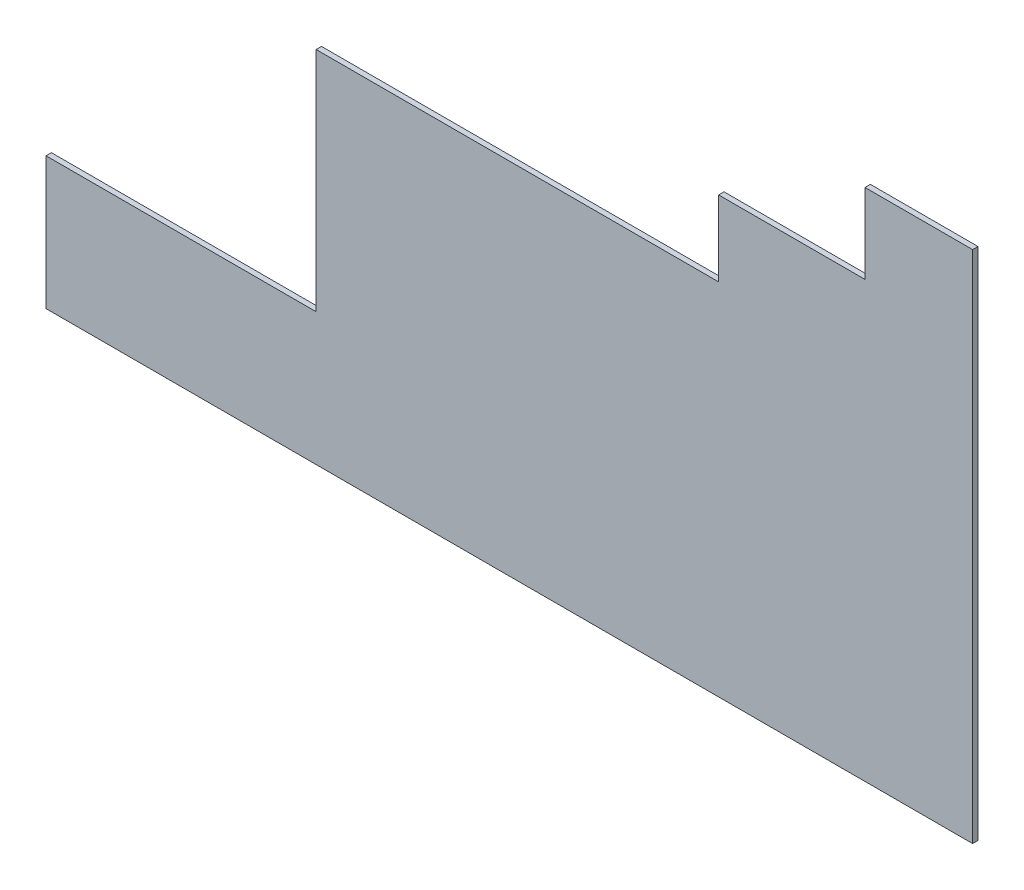
ISO-10303-21;
HEADER;
FILE_DESCRIPTION(('STEP AP214'),'2;1');
FILE_NAME('part.step','',(''),(''),'','','');
FILE_SCHEMA(('AUTOMOTIVE_DESIGN { 1 0 10303 214 1 1 1 1 }'));
ENDSEC;
DATA;
#1=APPLICATION_CONTEXT('core data for automotive mechanical design processes');
#2=APPLICATION_PROTOCOL_DEFINITION('international standard','automotive_design',2000,#1);
#3=PRODUCT_CONTEXT('',#1,'mechanical');
#4=PRODUCT('Part','Part','',(#3));
#5=PRODUCT_RELATED_PRODUCT_CATEGORY('part','',(#4));
#6=PRODUCT_DEFINITION_FORMATION('','',#4);
#7=PRODUCT_DEFINITION_CONTEXT('part definition',#1,'design');
#8=PRODUCT_DEFINITION('design','',#6,#7);
#9=PRODUCT_DEFINITION_SHAPE('','',#8);
#10=(LENGTH_UNIT() NAMED_UNIT(*) SI_UNIT(.MILLI.,.METRE.));
#11=(NAMED_UNIT(*) PLANE_ANGLE_UNIT() SI_UNIT($,.RADIAN.));
#12=(NAMED_UNIT(*) SI_UNIT($,.STERADIAN.) SOLID_ANGLE_UNIT());
#13=UNCERTAINTY_MEASURE_WITH_UNIT(LENGTH_MEASURE(1.E-05),#10,'distance_accuracy_value','');
#14=(GEOMETRIC_REPRESENTATION_CONTEXT(3) GLOBAL_UNCERTAINTY_ASSIGNED_CONTEXT((#13)) GLOBAL_UNIT_ASSIGNED_CONTEXT((#10,
#11,#12)) REPRESENTATION_CONTEXT('',''));
#15=CARTESIAN_POINT('',(0.,0.,0.));
#16=DIRECTION('',(0.,0.,1.));
#17=DIRECTION('',(1.,0.,0.));
#18=AXIS2_PLACEMENT_3D('',#15,#16,#17);
#19=CARTESIAN_POINT('',(6002.,0.,-25.));
#20=DIRECTION('',(0.,-1.,0.));
#21=DIRECTION('',(1.,0.,0.));
#22=AXIS2_PLACEMENT_3D('',#19,#20,#21);
#23=PLANE('',#22);
#24=DIRECTION('',(1.,0.,0.));
#25=VECTOR('',#24,1.);
#26=CARTESIAN_POINT('',(6002.,0.,0.));
#27=LINE('',#26,#25);
#28=CARTESIAN_POINT('',(1405.,0.,0.));
#29=VERTEX_POINT('',#28);
#30=CARTESIAN_POINT('',(5710.,0.,0.));
#31=VERTEX_POINT('',#30);
#32=EDGE_CURVE('E158',#29,#31,#27,.T.);
#33=ORIENTED_EDGE('',*,*,#32,.F.);
#34=DIRECTION('',(0.,0.,1.));
#35=VECTOR('',#34,1.);
#36=CARTESIAN_POINT('',(1405.,0.,-25.000025));
#37=LINE('',#36,#35);
#38=CARTESIAN_POINT('',(1405.,0.,-25.));
#39=VERTEX_POINT('',#38);
#40=EDGE_CURVE('E183',#39,#29,#37,.T.);
#41=ORIENTED_EDGE('',*,*,#40,.F.);
#42=DIRECTION('',(1.,0.,0.));
#43=VECTOR('',#42,1.);
#44=CARTESIAN_POINT('',(6002.,0.,-25.));
#45=LINE('',#44,#43);
#46=CARTESIAN_POINT('',(5710.,0.,-25.));
#47=VERTEX_POINT('',#46);
#48=EDGE_CURVE('E159',#39,#47,#45,.T.);
#49=ORIENTED_EDGE('',*,*,#48,.T.);
#50=DIRECTION('',(0.,0.,1.));
#51=VECTOR('',#50,1.);
#52=CARTESIAN_POINT('',(5710.,0.,-25.));
#53=LINE('',#52,#51);
#54=EDGE_CURVE('E149',#47,#31,#53,.T.);
#55=ORIENTED_EDGE('',*,*,#54,.T.);
#56=EDGE_LOOP('',(#33,#41,#49,#55));
#57=FACE_BOUND('',#56,.T.);
#58=ADVANCED_FACE('F40',(#57),#23,.T.);
#59=CARTESIAN_POINT('',(0.,0.,-25.));
#60=DIRECTION('',(0.,0.,-1.));
#61=DIRECTION('',(-1.,0.,0.));
#62=AXIS2_PLACEMENT_3D('',#59,#60,#61);
#63=PLANE('',#62);
#64=DIRECTION('',(-1.,0.,0.));
#65=VECTOR('',#64,1.);
#66=CARTESIAN_POINT('',(0.,615.,-25.));
#67=LINE('',#66,#65);
#68=CARTESIAN_POINT('',(2660.,615.,-25.));
#69=VERTEX_POINT('',#68);
#70=CARTESIAN_POINT('',(1405.,615.,-25.));
#71=VERTEX_POINT('',#70);
#72=EDGE_CURVE('E131',#69,#71,#67,.T.);
#73=ORIENTED_EDGE('',*,*,#72,.F.);
#74=DIRECTION('',(0.,1.,0.));
#75=VECTOR('',#74,1.);
#76=CARTESIAN_POINT('',(2660.,0.,-25.));
#77=LINE('',#76,#75);
#78=CARTESIAN_POINT('',(2660.,1670.,-25.));
#79=VERTEX_POINT('',#78);
#80=EDGE_CURVE('E117',#69,#79,#77,.T.);
#81=ORIENTED_EDGE('',*,*,#80,.T.);
#82=DIRECTION('',(1.,0.,0.));
#83=VECTOR('',#82,1.);
#84=CARTESIAN_POINT('',(4300.,1670.,-25.));
#85=LINE('',#84,#83);
#86=CARTESIAN_POINT('',(4530.,1670.,-25.));
#87=VERTEX_POINT('',#86);
#88=EDGE_CURVE('E128',#79,#87,#85,.T.);
#89=ORIENTED_EDGE('',*,*,#88,.T.);
#90=DIRECTION('',(0.,1.,0.));
#91=VECTOR('',#90,1.);
#92=CARTESIAN_POINT('',(4530.,1670.,-25.));
#93=LINE('',#92,#91);
#94=CARTESIAN_POINT('',(4530.,2020.,-25.));
#95=VERTEX_POINT('',#94);
#96=EDGE_CURVE('E197',#87,#95,#93,.T.);
#97=ORIENTED_EDGE('',*,*,#96,.T.);
#98=DIRECTION('',(-1.,0.,0.));
#99=VECTOR('',#98,1.);
#100=CARTESIAN_POINT('',(2935.,2020.,-25.));
#101=LINE('',#100,#99);
#102=CARTESIAN_POINT('',(5210.,2020.,-25.));
#103=VERTEX_POINT('',#102);
#104=EDGE_CURVE('E161',#103,#95,#101,.T.);
#105=ORIENTED_EDGE('',*,*,#104,.F.);
#106=DIRECTION('',(0.,1.,0.));
#107=VECTOR('',#106,1.);
#108=CARTESIAN_POINT('',(5210.,2515.,-25.));
#109=LINE('',#108,#107);
#110=CARTESIAN_POINT('',(5210.,2390.,-25.));
#111=VERTEX_POINT('',#110);
#112=EDGE_CURVE('E152',#103,#111,#109,.T.);
#113=ORIENTED_EDGE('',*,*,#112,.T.);
#114=DIRECTION('',(1.,0.,0.));
#115=VECTOR('',#114,1.);
#116=CARTESIAN_POINT('',(5210.,2390.,-25.));
#117=LINE('',#116,#115);
#118=CARTESIAN_POINT('',(5710.,2390.,-25.));
#119=VERTEX_POINT('',#118);
#120=EDGE_CURVE('E199',#111,#119,#117,.T.);
#121=ORIENTED_EDGE('',*,*,#120,.T.);
#122=DIRECTION('',(0.,-1.,0.));
#123=VECTOR('',#122,1.);
#124=CARTESIAN_POINT('',(5710.,2515.,-25.));
#125=LINE('',#124,#123);
#126=EDGE_CURVE('E140',#119,#47,#125,.T.);
#127=ORIENTED_EDGE('',*,*,#126,.T.);
#128=ORIENTED_EDGE('',*,*,#48,.F.);
#129=DIRECTION('',(0.,1.,0.));
#130=VECTOR('',#129,1.);
#131=CARTESIAN_POINT('',(1405.,0.,-25.));
#132=LINE('',#131,#130);
#133=EDGE_CURVE('E132',#39,#71,#132,.T.);
#134=ORIENTED_EDGE('',*,*,#133,.T.);
#135=EDGE_LOOP('',(#73,#81,#89,#97,#105,#113,#121,#127,#128,#134));
#136=FACE_BOUND('',#135,.T.);
#137=ADVANCED_FACE('F126',(#136),#63,.T.);
#138=CARTESIAN_POINT('',(0.,0.,0.));
#139=DIRECTION('',(0.,0.,-1.));
#140=DIRECTION('',(-1.,0.,0.));
#141=AXIS2_PLACEMENT_3D('',#138,#139,#140);
#142=PLANE('',#141);
#143=DIRECTION('',(0.,1.,0.));
#144=VECTOR('',#143,1.);
#145=CARTESIAN_POINT('',(2660.,0.,0.));
#146=LINE('',#145,#144);
#147=CARTESIAN_POINT('',(2660.,615.,0.));
#148=VERTEX_POINT('',#147);
#149=CARTESIAN_POINT('',(2660.,1670.,0.));
#150=VERTEX_POINT('',#149);
#151=EDGE_CURVE('E54',#148,#150,#146,.T.);
#152=ORIENTED_EDGE('',*,*,#151,.F.);
#153=DIRECTION('',(-1.,0.,0.));
#154=VECTOR('',#153,1.);
#155=CARTESIAN_POINT('',(0.,615.,0.));
#156=LINE('',#155,#154);
#157=CARTESIAN_POINT('',(1405.,615.,0.));
#158=VERTEX_POINT('',#157);
#159=EDGE_CURVE('E11',#148,#158,#156,.T.);
#160=ORIENTED_EDGE('',*,*,#159,.T.);
#161=DIRECTION('',(0.,1.,0.));
#162=VECTOR('',#161,1.);
#163=CARTESIAN_POINT('',(1405.,0.,0.));
#164=LINE('',#163,#162);
#165=EDGE_CURVE('E47',#29,#158,#164,.T.);
#166=ORIENTED_EDGE('',*,*,#165,.F.);
#167=ORIENTED_EDGE('',*,*,#32,.T.);
#168=DIRECTION('',(0.,1.,0.));
#169=VECTOR('',#168,1.);
#170=CARTESIAN_POINT('',(5710.,0.,0.));
#171=LINE('',#170,#169);
#172=CARTESIAN_POINT('',(5710.,2390.,0.));
#173=VERTEX_POINT('',#172);
#174=EDGE_CURVE('E170',#31,#173,#171,.T.);
#175=ORIENTED_EDGE('',*,*,#174,.T.);
#176=DIRECTION('',(-1.,0.,0.));
#177=VECTOR('',#176,1.);
#178=CARTESIAN_POINT('',(0.,2390.,0.));
#179=LINE('',#178,#177);
#180=CARTESIAN_POINT('',(5210.,2390.,0.));
#181=VERTEX_POINT('',#180);
#182=EDGE_CURVE('E62',#173,#181,#179,.T.);
#183=ORIENTED_EDGE('',*,*,#182,.T.);
#184=DIRECTION('',(0.,-1.,0.));
#185=VECTOR('',#184,1.);
#186=CARTESIAN_POINT('',(5210.,0.,0.));
#187=LINE('',#186,#185);
#188=CARTESIAN_POINT('',(5210.,2020.,0.));
#189=VERTEX_POINT('',#188);
#190=EDGE_CURVE('E165',#181,#189,#187,.T.);
#191=ORIENTED_EDGE('',*,*,#190,.T.);
#192=DIRECTION('',(-1.,0.,0.));
#193=VECTOR('',#192,1.);
#194=CARTESIAN_POINT('',(2935.,2020.,0.));
#195=LINE('',#194,#193);
#196=CARTESIAN_POINT('',(4530.,2020.,0.));
#197=VERTEX_POINT('',#196);
#198=EDGE_CURVE('E162',#189,#197,#195,.T.);
#199=ORIENTED_EDGE('',*,*,#198,.T.);
#200=DIRECTION('',(0.,-1.,0.));
#201=VECTOR('',#200,1.);
#202=CARTESIAN_POINT('',(4530.,0.,0.));
#203=LINE('',#202,#201);
#204=CARTESIAN_POINT('',(4530.,1670.,0.));
#205=VERTEX_POINT('',#204);
#206=EDGE_CURVE('E122',#197,#205,#203,.T.);
#207=ORIENTED_EDGE('',*,*,#206,.T.);
#208=DIRECTION('',(-1.,0.,0.));
#209=VECTOR('',#208,1.);
#210=CARTESIAN_POINT('',(-2.55734131189519E-13,1670.,0.));
#211=LINE('',#210,#209);
#212=EDGE_CURVE('E138',#205,#150,#211,.T.);
#213=ORIENTED_EDGE('',*,*,#212,.T.);
#214=EDGE_LOOP('',(#152,#160,#166,#167,#175,#183,#191,#199,#207,#213));
#215=FACE_BOUND('',#214,.T.);
#216=ADVANCED_FACE('F190',(#215),#142,.F.);
#217=CARTESIAN_POINT('',(4300.,1670.,-25.));
#218=DIRECTION('',(0.,-1.,0.));
#219=DIRECTION('',(1.,0.,0.));
#220=AXIS2_PLACEMENT_3D('',#217,#218,#219);
#221=PLANE('',#220);
#222=DIRECTION('',(0.,0.,-1.));
#223=VECTOR('',#222,1.);
#224=CARTESIAN_POINT('',(2660.,1670.,-25.));
#225=LINE('',#224,#223);
#226=EDGE_CURVE('E114',#150,#79,#225,.T.);
#227=ORIENTED_EDGE('',*,*,#226,.F.);
#228=ORIENTED_EDGE('',*,*,#212,.F.);
#229=DIRECTION('',(0.,0.,1.));
#230=VECTOR('',#229,1.);
#231=CARTESIAN_POINT('',(4530.,1670.,-25.));
#232=LINE('',#231,#230);
#233=EDGE_CURVE('E136',#87,#205,#232,.T.);
#234=ORIENTED_EDGE('',*,*,#233,.F.);
#235=ORIENTED_EDGE('',*,*,#88,.F.);
#236=EDGE_LOOP('',(#227,#228,#234,#235));
#237=FACE_BOUND('',#236,.T.);
#238=ADVANCED_FACE('F134',(#237),#221,.F.);
#239=CARTESIAN_POINT('',(2935.,2020.,-25.));
#240=DIRECTION('',(0.,1.,0.));
#241=DIRECTION('',(0.,0.,1.));
#242=AXIS2_PLACEMENT_3D('',#239,#240,#241);
#243=PLANE('',#242);
#244=DIRECTION('',(0.,0.,1.));
#245=VECTOR('',#244,1.);
#246=CARTESIAN_POINT('',(4530.,2020.,-25.));
#247=LINE('',#246,#245);
#248=EDGE_CURVE('E204',#95,#197,#247,.T.);
#249=ORIENTED_EDGE('',*,*,#248,.T.);
#250=ORIENTED_EDGE('',*,*,#198,.F.);
#251=DIRECTION('',(0.,0.,1.));
#252=VECTOR('',#251,1.);
#253=CARTESIAN_POINT('',(5210.,2020.,-25.));
#254=LINE('',#253,#252);
#255=EDGE_CURVE('E155',#103,#189,#254,.T.);
#256=ORIENTED_EDGE('',*,*,#255,.F.);
#257=ORIENTED_EDGE('',*,*,#104,.T.);
#258=EDGE_LOOP('',(#249,#250,#256,#257));
#259=FACE_BOUND('',#258,.T.);
#260=ADVANCED_FACE('F226',(#259),#243,.T.);
#261=CARTESIAN_POINT('',(5210.,2515.,-25.));
#262=DIRECTION('',(1.,0.,0.));
#263=DIRECTION('',(0.,0.,-1.));
#264=AXIS2_PLACEMENT_3D('',#261,#262,#263);
#265=PLANE('',#264);
#266=ORIENTED_EDGE('',*,*,#190,.F.);
#267=DIRECTION('',(0.,0.,1.));
#268=VECTOR('',#267,1.);
#269=CARTESIAN_POINT('',(5210.,2390.,-25.));
#270=LINE('',#269,#268);
#271=EDGE_CURVE('E202',#111,#181,#270,.T.);
#272=ORIENTED_EDGE('',*,*,#271,.F.);
#273=ORIENTED_EDGE('',*,*,#112,.F.);
#274=ORIENTED_EDGE('',*,*,#255,.T.);
#275=EDGE_LOOP('',(#266,#272,#273,#274));
#276=FACE_BOUND('',#275,.T.);
#277=ADVANCED_FACE('F222',(#276),#265,.F.);
#278=CARTESIAN_POINT('',(5710.,2515.,-25.));
#279=DIRECTION('',(-1.,0.,0.));
#280=DIRECTION('',(0.,0.,1.));
#281=AXIS2_PLACEMENT_3D('',#278,#279,#280);
#282=PLANE('',#281);
#283=ORIENTED_EDGE('',*,*,#126,.F.);
#284=DIRECTION('',(0.,0.,1.));
#285=VECTOR('',#284,1.);
#286=CARTESIAN_POINT('',(5710.,2390.,-25.));
#287=LINE('',#286,#285);
#288=EDGE_CURVE('E142',#119,#173,#287,.T.);
#289=ORIENTED_EDGE('',*,*,#288,.T.);
#290=ORIENTED_EDGE('',*,*,#174,.F.);
#291=ORIENTED_EDGE('',*,*,#54,.F.);
#292=EDGE_LOOP('',(#283,#289,#290,#291));
#293=FACE_BOUND('',#292,.T.);
#294=ADVANCED_FACE('F213',(#293),#282,.F.);
#295=CARTESIAN_POINT('',(4530.,1670.,-25.));
#296=DIRECTION('',(1.,0.,0.));
#297=DIRECTION('',(0.,0.,-1.));
#298=AXIS2_PLACEMENT_3D('',#295,#296,#297);
#299=PLANE('',#298);
#300=ORIENTED_EDGE('',*,*,#248,.F.);
#301=ORIENTED_EDGE('',*,*,#96,.F.);
#302=ORIENTED_EDGE('',*,*,#233,.T.);
#303=ORIENTED_EDGE('',*,*,#206,.F.);
#304=EDGE_LOOP('',(#300,#301,#302,#303));
#305=FACE_BOUND('',#304,.T.);
#306=ADVANCED_FACE('F228',(#305),#299,.F.);
#307=CARTESIAN_POINT('',(5210.,2390.,-25.));
#308=DIRECTION('',(0.,-1.,0.));
#309=DIRECTION('',(0.,0.,-1.));
#310=AXIS2_PLACEMENT_3D('',#307,#308,#309);
#311=PLANE('',#310);
#312=ORIENTED_EDGE('',*,*,#288,.F.);
#313=ORIENTED_EDGE('',*,*,#120,.F.);
#314=ORIENTED_EDGE('',*,*,#271,.T.);
#315=ORIENTED_EDGE('',*,*,#182,.F.);
#316=EDGE_LOOP('',(#312,#313,#314,#315));
#317=FACE_BOUND('',#316,.T.);
#318=ADVANCED_FACE('F220',(#317),#311,.F.);
#319=CARTESIAN_POINT('',(0.,615.,-25.000025));
#320=DIRECTION('',(0.,-1.,0.));
#321=DIRECTION('',(0.,0.,-1.));
#322=AXIS2_PLACEMENT_3D('',#319,#320,#321);
#323=PLANE('',#322);
#324=ORIENTED_EDGE('',*,*,#72,.T.);
#325=DIRECTION('',(0.,0.,1.));
#326=VECTOR('',#325,1.);
#327=CARTESIAN_POINT('',(1405.,615.,-25.000025));
#328=LINE('',#327,#326);
#329=EDGE_CURVE('E181',#71,#158,#328,.T.);
#330=ORIENTED_EDGE('',*,*,#329,.T.);
#331=ORIENTED_EDGE('',*,*,#159,.F.);
#332=DIRECTION('',(0.,0.,1.));
#333=VECTOR('',#332,1.);
#334=CARTESIAN_POINT('',(2660.,615.,-25.000025));
#335=LINE('',#334,#333);
#336=EDGE_CURVE('E188',#69,#148,#335,.T.);
#337=ORIENTED_EDGE('',*,*,#336,.F.);
#338=EDGE_LOOP('',(#324,#330,#331,#337));
#339=FACE_BOUND('',#338,.T.);
#340=ADVANCED_FACE('F187',(#339),#323,.F.);
#341=CARTESIAN_POINT('',(1405.,0.,-25.000025));
#342=DIRECTION('',(-1.,0.,0.));
#343=DIRECTION('',(0.,0.,1.));
#344=AXIS2_PLACEMENT_3D('',#341,#342,#343);
#345=PLANE('',#344);
#346=ORIENTED_EDGE('',*,*,#40,.T.);
#347=ORIENTED_EDGE('',*,*,#165,.T.);
#348=ORIENTED_EDGE('',*,*,#329,.F.);
#349=ORIENTED_EDGE('',*,*,#133,.F.);
#350=EDGE_LOOP('',(#346,#347,#348,#349));
#351=FACE_BOUND('',#350,.T.);
#352=ADVANCED_FACE('F180',(#351),#345,.T.);
#353=CARTESIAN_POINT('',(2660.,0.,-25.000025));
#354=DIRECTION('',(-1.,0.,0.));
#355=DIRECTION('',(0.,0.,1.));
#356=AXIS2_PLACEMENT_3D('',#353,#354,#355);
#357=PLANE('',#356);
#358=ORIENTED_EDGE('',*,*,#336,.T.);
#359=ORIENTED_EDGE('',*,*,#151,.T.);
#360=ORIENTED_EDGE('',*,*,#226,.T.);
#361=ORIENTED_EDGE('',*,*,#80,.F.);
#362=EDGE_LOOP('',(#358,#359,#360,#361));
#363=FACE_BOUND('',#362,.T.);
#364=ADVANCED_FACE('F116',(#363),#357,.T.);
#365=CLOSED_SHELL('',(#58,#137,#216,#238,#260,#277,#294,#306,#318,#340,#352,#364));
#366=MANIFOLD_SOLID_BREP('B2',#365);
#367=ADVANCED_BREP_SHAPE_REPRESENTATION('',(#18,#366),#14);
#368=SHAPE_DEFINITION_REPRESENTATION(#9,#367);
ENDSEC;
END-ISO-10303-21;
